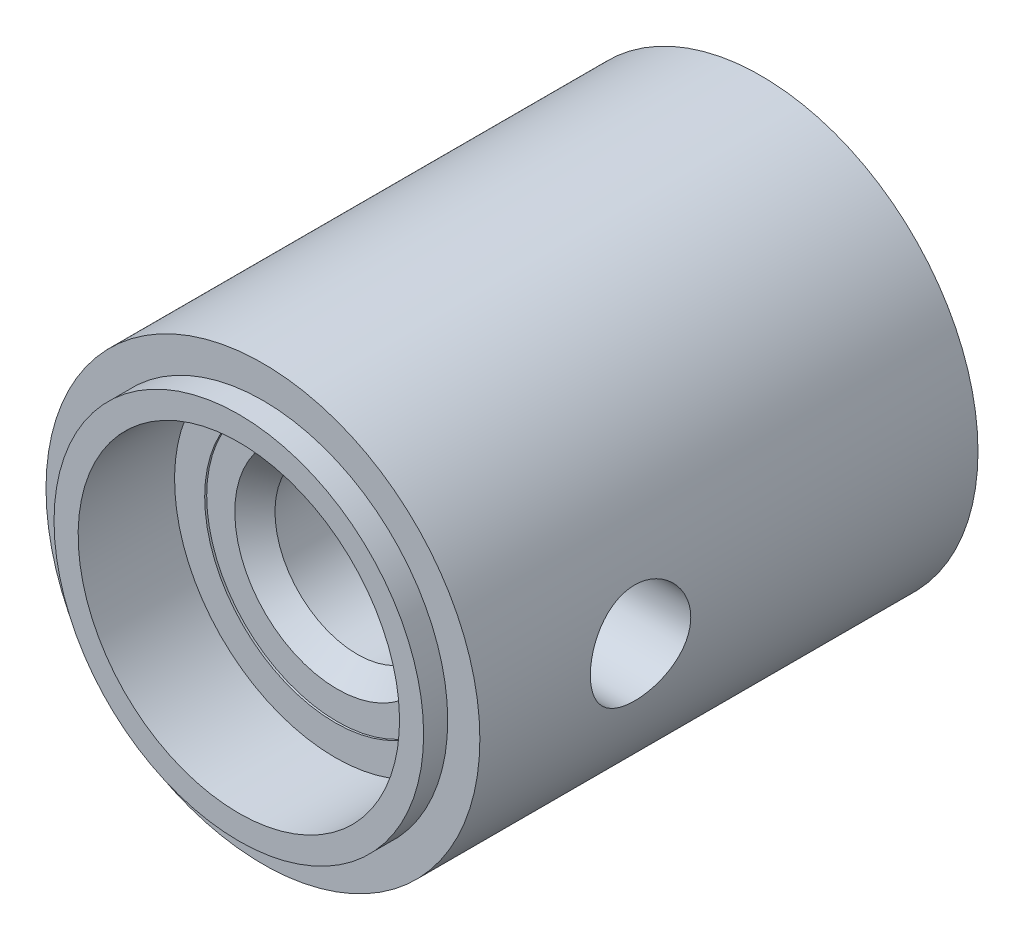
ISO-10303-21;
HEADER;
FILE_DESCRIPTION(('STEP AP214'),'2;1');
FILE_NAME('part.step','',(''),(''),'','','');
FILE_SCHEMA(('AUTOMOTIVE_DESIGN { 1 0 10303 214 1 1 1 1 }'));
ENDSEC;
DATA;
#1=APPLICATION_CONTEXT('core data for automotive mechanical design processes');
#2=APPLICATION_PROTOCOL_DEFINITION('international standard','automotive_design',2000,#1);
#3=PRODUCT_CONTEXT('',#1,'mechanical');
#4=PRODUCT('Part','Part','',(#3));
#5=PRODUCT_RELATED_PRODUCT_CATEGORY('part','',(#4));
#6=PRODUCT_DEFINITION_FORMATION('','',#4);
#7=PRODUCT_DEFINITION_CONTEXT('part definition',#1,'design');
#8=PRODUCT_DEFINITION('design','',#6,#7);
#9=PRODUCT_DEFINITION_SHAPE('','',#8);
#10=(LENGTH_UNIT() NAMED_UNIT(*) SI_UNIT(.MILLI.,.METRE.));
#11=(NAMED_UNIT(*) PLANE_ANGLE_UNIT() SI_UNIT($,.RADIAN.));
#12=(NAMED_UNIT(*) SI_UNIT($,.STERADIAN.) SOLID_ANGLE_UNIT());
#13=UNCERTAINTY_MEASURE_WITH_UNIT(LENGTH_MEASURE(1.E-05),#10,'distance_accuracy_value','');
#14=(GEOMETRIC_REPRESENTATION_CONTEXT(3) GLOBAL_UNCERTAINTY_ASSIGNED_CONTEXT((#13)) GLOBAL_UNIT_ASSIGNED_CONTEXT((#10,
#11,#12)) REPRESENTATION_CONTEXT('',''));
#15=CARTESIAN_POINT('',(0.,0.,0.));
#16=DIRECTION('',(0.,0.,1.));
#17=DIRECTION('',(1.,0.,0.));
#18=AXIS2_PLACEMENT_3D('',#15,#16,#17);
#19=CARTESIAN_POINT('',(0.,0.,124.));
#20=DIRECTION('',(0.,0.,-1.));
#21=DIRECTION('',(-1.,0.,0.));
#22=AXIS2_PLACEMENT_3D('',#19,#20,#21);
#23=CYLINDRICAL_SURFACE('',#22,54.);
#24=CARTESIAN_POINT('',(54.,2.22044604925031E-13,96.5));
#25=CARTESIAN_POINT('',(53.9999991283518,-0.346154811254162,96.4999983442547));
#26=CARTESIAN_POINT('',(53.9966631813621,-0.69234445027759,96.4856090232887));
#27=CARTESIAN_POINT('',(53.9834095670314,-1.38223725812821,96.4281644914496));
#28=CARTESIAN_POINT('',(53.9734910051967,-1.72594008261138,96.3851053847144));
#29=CARTESIAN_POINT('',(53.9473406441938,-2.40856064193267,96.2706425007982));
#30=CARTESIAN_POINT('',(53.9311051130138,-2.74747542514791,96.1992219674129));
#31=CARTESIAN_POINT('',(53.8927711589579,-3.41788796121193,96.0286193378688));
#32=CARTESIAN_POINT('',(53.8706729204595,-3.74938594695788,95.929438114757));
#33=CARTESIAN_POINT('',(53.8212482643726,-4.40230784196444,95.7042219597272));
#34=CARTESIAN_POINT('',(53.7939277090089,-4.72374258112491,95.5782171203545));
#35=CARTESIAN_POINT('',(53.7347847258636,-5.35474947369891,95.3002443205053));
#36=CARTESIAN_POINT('',(53.7029622674806,-5.6643215464583,95.148276183543));
#37=CARTESIAN_POINT('',(53.6356745163034,-6.26954008411762,94.8194944494338));
#38=CARTESIAN_POINT('',(53.6002093920336,-6.56518719232,94.642682001545));
#39=CARTESIAN_POINT('',(53.5265827388403,-7.14066585505397,94.265440636423));
#40=CARTESIAN_POINT('',(53.4884210995295,-7.42049676127224,94.0650107521375));
#41=CARTESIAN_POINT('',(53.4097951495491,-7.96688060824163,93.638507915042));
#42=CARTESIAN_POINT('',(53.3693037700556,-8.23314955810788,93.4120760638685));
#43=CARTESIAN_POINT('',(53.2877021597603,-8.74575164569198,92.9377717260088));
#44=CARTESIAN_POINT('',(53.2465919225227,-8.99208457591438,92.6898990162202));
#45=CARTESIAN_POINT('',(53.1648841798376,-9.46320609880626,92.174330764967));
#46=CARTESIAN_POINT('',(53.124286730884,-9.68799233533919,91.9066330612946));
#47=CARTESIAN_POINT('',(53.0447424166067,-10.1144633177635,91.3532080291935));
#48=CARTESIAN_POINT('',(53.0057955091764,-10.3161486531992,91.0674811611651));
#49=CARTESIAN_POINT('',(52.9301788734753,-10.6974026393397,90.4761771796908));
#50=CARTESIAN_POINT('',(52.8935439195541,-10.8766614460573,90.1703957088886));
#51=CARTESIAN_POINT('',(52.8241723423021,-11.2087289371851,89.5443612932754));
#52=CARTESIAN_POINT('',(52.791435760623,-11.3615373389966,89.2241081938942));
#53=CARTESIAN_POINT('',(52.7308468238226,-11.6395034671342,88.5714072002391));
#54=CARTESIAN_POINT('',(52.7029939555448,-11.7646640989111,88.2389605916431));
#55=CARTESIAN_POINT('',(52.6530205810564,-11.98634011075,87.5642310010921));
#56=CARTESIAN_POINT('',(52.6308999583988,-12.0828560727165,87.2219482191097));
#57=CARTESIAN_POINT('',(52.593406459515,-12.2450156136681,86.5360633360931));
#58=CARTESIAN_POINT('',(52.5779233094249,-12.3111651273173,86.1925868497247));
#59=CARTESIAN_POINT('',(52.5536279634346,-12.4144678669358,85.5010662246167));
#60=CARTESIAN_POINT('',(52.5448156977575,-12.4516213962007,85.1530221336927));
#61=CARTESIAN_POINT('',(52.534134006356,-12.4966115889184,84.4549800185812));
#62=CARTESIAN_POINT('',(52.5322637408562,-12.5044517984113,84.1049822358628));
#63=CARTESIAN_POINT('',(52.5355216779213,-12.4907570865095,83.4055968826546));
#64=CARTESIAN_POINT('',(52.5406497990204,-12.4692225070572,83.056209305109));
#65=CARTESIAN_POINT('',(52.5575693224059,-12.3977101268883,82.3678029453307));
#66=CARTESIAN_POINT('',(52.5692213997841,-12.3483269049185,82.0287187648615));
#67=CARTESIAN_POINT('',(52.5987427900533,-12.2219662998623,81.3560139805664));
#68=CARTESIAN_POINT('',(52.6166120048043,-12.1449893523528,81.0223932905842));
#69=CARTESIAN_POINT('',(52.6580491731704,-11.9640486595974,80.3629044380509));
#70=CARTESIAN_POINT('',(52.6816173695984,-11.8600837644793,80.0370366064707));
#71=CARTESIAN_POINT('',(52.7337774815675,-11.6259658900512,79.3952640742824));
#72=CARTESIAN_POINT('',(52.7623694656518,-11.4958125534296,79.0793595096797));
#73=CARTESIAN_POINT('',(52.8240431330697,-11.2090212041611,78.4568680796184));
#74=CARTESIAN_POINT('',(52.8571621015704,-11.052160266269,78.1503876361584));
#75=CARTESIAN_POINT('',(52.9267633238893,-10.7138940748925,77.5516906525274));
#76=CARTESIAN_POINT('',(52.9632455888741,-10.5324887399157,77.2594741597201));
#77=CARTESIAN_POINT('',(53.0385709544605,-10.1463625266328,76.6911447045009));
#78=CARTESIAN_POINT('',(53.0774143545079,-9.94163868811931,76.4150337933821));
#79=CARTESIAN_POINT('',(53.1564017717327,-9.51025868127216,75.8807091808685));
#80=CARTESIAN_POINT('',(53.1965458103184,-9.28360215180646,75.6224957742847));
#81=CARTESIAN_POINT('',(53.2780357860342,-8.80405958725021,75.1195622179907));
#82=CARTESIAN_POINT('',(53.3193871999183,-8.55066951251391,74.8753232852663));
#83=CARTESIAN_POINT('',(53.4011659668759,-8.02411651246397,74.4090023152823));
#84=CARTESIAN_POINT('',(53.4415933044523,-7.75095325586504,74.1869206494));
#85=CARTESIAN_POINT('',(53.5203973183108,-7.18666911594677,73.7664477662748));
#86=CARTESIAN_POINT('',(53.5587739322229,-6.89554768703433,73.5680572693391));
#87=CARTESIAN_POINT('',(53.6324032072448,-6.29731187622616,73.196395727014));
#88=CARTESIAN_POINT('',(53.6676558856672,-5.99019758297667,73.0231245424117));
#89=CARTESIAN_POINT('',(53.7341356663869,-5.36124162145522,72.702566740351));
#90=CARTESIAN_POINT('',(53.7653519239785,-5.0393633021194,72.5553497476753));
#91=CARTESIAN_POINT('',(53.8227622151943,-4.38388963816578,72.2886077574731));
#92=CARTESIAN_POINT('',(53.8489562258813,-4.05029424004299,72.1690828864191));
#93=CARTESIAN_POINT('',(53.8955672984906,-3.37383201241038,71.9587083889404));
#94=CARTESIAN_POINT('',(53.9159851285109,-3.03096642227039,71.8678549496949));
#95=CARTESIAN_POINT('',(53.9504571358018,-2.338450048876,71.7155652988398));
#96=CARTESIAN_POINT('',(53.9645114463164,-1.98879940785169,71.654128471283));
#97=CARTESIAN_POINT('',(53.9856113209214,-1.29312912151582,71.5622275957371));
#98=CARTESIAN_POINT('',(53.9928051533255,-0.947200447517947,71.5311079971349));
#99=CARTESIAN_POINT('',(54.000515951648,-0.253881031118812,71.497760605153));
#100=CARTESIAN_POINT('',(54.0010330159946,0.0935096896535838,71.4955323858596));
#101=CARTESIAN_POINT('',(53.9953760257445,0.787191219314259,71.5199851118093));
#102=CARTESIAN_POINT('',(53.9892024452853,1.13348210439915,71.5466640085284));
#103=CARTESIAN_POINT('',(53.9703379362719,1.8224679295123,71.628703881468));
#104=CARTESIAN_POINT('',(53.957647027737,2.16516288058288,71.6840647695861));
#105=CARTESIAN_POINT('',(53.9262993913182,2.84024646049301,71.8221422224451));
#106=CARTESIAN_POINT('',(53.9077190956459,3.17271033796417,71.9045087559264));
#107=CARTESIAN_POINT('',(53.8650511507829,3.82943172075758,72.0961161149275));
#108=CARTESIAN_POINT('',(53.8409635616657,4.15368931555102,72.205356647307));
#109=CARTESIAN_POINT('',(53.7879245432152,4.79183724144157,72.449889024993));
#110=CARTESIAN_POINT('',(53.7589727838715,5.1057268673922,72.5851826379655));
#111=CARTESIAN_POINT('',(53.6969754060504,5.72105467679928,72.8808252302677));
#112=CARTESIAN_POINT('',(53.6639297209581,6.02249265754044,73.0411746173074));
#113=CARTESIAN_POINT('',(53.5940716524558,6.61559118610248,73.3885016645606));
#114=CARTESIAN_POINT('',(53.5572083372605,6.90702434920809,73.5758573898678));
#115=CARTESIAN_POINT('',(53.4811531118696,7.47314179330541,73.9739391462593));
#116=CARTESIAN_POINT('',(53.4419611814102,7.74782592850305,74.1846653807302));
#117=CARTESIAN_POINT('',(53.3623003215942,8.27870597619139,74.6280921099851));
#118=CARTESIAN_POINT('',(53.3218312273121,8.53489948675223,74.8607954505614));
#119=CARTESIAN_POINT('',(53.240713938067,9.02710404041089,75.3466209227704));
#120=CARTESIAN_POINT('',(53.2000657414841,9.26311490055341,75.5997432394602));
#121=CARTESIAN_POINT('',(53.118856966559,9.71810469976796,76.1302428023199));
#122=CARTESIAN_POINT('',(53.0783158644566,9.93662624499617,76.4080155621387));
#123=CARTESIAN_POINT('',(52.99935856096,10.3495017368867,76.9812687982107));
#124=CARTESIAN_POINT('',(52.9609423926388,10.5438553074487,77.2767495499285));
#125=CARTESIAN_POINT('',(52.887352327669,10.9069839571498,77.8834103091074));
#126=CARTESIAN_POINT('',(52.8521783471664,11.075759697891,78.1945899102209));
#127=CARTESIAN_POINT('',(52.7861119851401,11.3864667204613,78.8305121708548));
#128=CARTESIAN_POINT('',(52.7552195502476,11.5283983369069,79.1552546612498));
#129=CARTESIAN_POINT('',(52.6988135249575,11.7835494282462,79.814070071756));
#130=CARTESIAN_POINT('',(52.673269296781,11.8969332453062,80.1480766958869));
#131=CARTESIAN_POINT('',(52.6281064050513,12.0951545193151,80.8248524566868));
#132=CARTESIAN_POINT('',(52.6084877313804,12.1799920250056,81.1676215783932));
#133=CARTESIAN_POINT('',(52.5757835707764,12.3203971684642,81.8593582756879));
#134=CARTESIAN_POINT('',(52.5626970836535,12.375969287337,82.208324893854));
#135=CARTESIAN_POINT('',(52.5434618506543,12.4573823608586,82.9098968500441));
#136=CARTESIAN_POINT('',(52.537312966193,12.4832239094028,83.2625021152409));
#137=CARTESIAN_POINT('',(52.5322088211595,12.5046850037835,83.9600128575298));
#138=CARTESIAN_POINT('',(52.5330807295311,12.5010306458017,84.3048949410186));
#139=CARTESIAN_POINT('',(52.5415820900508,12.4652512831434,84.9930906692949));
#140=CARTESIAN_POINT('',(52.5492114252959,12.4331267709985,85.3364043411125));
#141=CARTESIAN_POINT('',(52.570999228181,12.3406761701925,86.0189924805737));
#142=CARTESIAN_POINT('',(52.5851575575558,12.280350678746,86.358267033598));
#143=CARTESIAN_POINT('',(52.6195836271821,12.1319911232341,87.0303847220212));
#144=CARTESIAN_POINT('',(52.639851396669,12.0439569265735,87.3632278266353));
#145=CARTESIAN_POINT('',(52.6858019985167,11.8413259313471,88.0187275407687));
#146=CARTESIAN_POINT('',(52.7114606411166,11.7268475713262,88.3414224895167));
#147=CARTESIAN_POINT('',(52.7675137672462,11.4719876960415,88.975982848749));
#148=CARTESIAN_POINT('',(52.7979082241729,11.3316063262846,89.2878483200548));
#149=CARTESIAN_POINT('',(52.8625846438323,11.0259482557329,89.89873977075));
#150=CARTESIAN_POINT('',(52.8968669456865,10.8606693828131,90.1977646269617));
#151=CARTESIAN_POINT('',(52.9683745072335,10.5063765555461,90.7810391649284));
#152=CARTESIAN_POINT('',(53.0055998400893,10.317362011069,91.0652884790766));
#153=CARTESIAN_POINT('',(53.0828480832215,9.91234974349647,91.623442619069));
#154=CARTESIAN_POINT('',(53.1229151445021,9.69583974974958,91.8969697426979));
#155=CARTESIAN_POINT('',(53.2039567495494,9.24079968882185,92.4249078078079));
#156=CARTESIAN_POINT('',(53.2449313079634,9.00226926602428,92.6793184404489));
#157=CARTESIAN_POINT('',(53.3266665207499,8.50471608944755,93.167402932645));
#158=CARTESIAN_POINT('',(53.3674271240656,8.24568866209009,93.4010720369477));
#159=CARTESIAN_POINT('',(53.4476063086294,7.70889164492517,93.8460411810655));
#160=CARTESIAN_POINT('',(53.487024894671,7.43112212207282,94.0573413007856));
#161=CARTESIAN_POINT('',(53.5640125579013,6.85437396403341,94.4591064592991));
#162=CARTESIAN_POINT('',(53.6015451336883,6.55514015977679,94.6492124190875));
#163=CARTESIAN_POINT('',(53.6730528417528,5.94128449750717,95.0034865070261));
#164=CARTESIAN_POINT('',(53.7070279913817,5.62666271455964,95.1676547616889));
#165=CARTESIAN_POINT('',(53.7704318481082,4.9844459222645,95.4686959500955));
#166=CARTESIAN_POINT('',(53.7998636536349,4.65685994737794,95.6055875044509));
#167=CARTESIAN_POINT('',(53.8533607293085,3.99087270218004,95.8511113262724));
#168=CARTESIAN_POINT('',(53.8774268991715,3.6524732559812,95.9597483320046));
#169=CARTESIAN_POINT('',(53.914978426723,3.04101293399396,96.1276561331388));
#170=CARTESIAN_POINT('',(53.9296261903094,2.76954333941325,96.1925188041302));
#171=CARTESIAN_POINT('',(53.9549302082044,2.22269971359777,96.3039607246162));
#172=CARTESIAN_POINT('',(53.9655867529436,1.947325967972,96.3505413044631));
#173=CARTESIAN_POINT('',(53.9827159921762,1.39392147156101,96.4251739334183));
#174=CARTESIAN_POINT('',(53.9891882729649,1.11589046080479,96.4532241504065));
#175=CARTESIAN_POINT('',(53.9978301485338,0.558580329813716,96.4906357668074));
#176=CARTESIAN_POINT('',(54.0000007033057,0.279301501993409,96.5000013359692));
#177=CARTESIAN_POINT('',(54.,2.22044604925031E-13,96.5));
#178=B_SPLINE_CURVE_WITH_KNOTS('',3,(#24,#25,#26,#27,#28,#29,#30,#31,#32,#33,#34,#35,#36,#37,
#38,#39,#40,#41,#42,#43,#44,#45,#46,#47,#48,#49,#50,#51,#52,#53,#54,#55,#56,#57,#58,#59,#60,#61,
#62,#63,#64,#65,#66,#67,#68,#69,#70,#71,#72,#73,#74,#75,#76,#77,#78,#79,#80,#81,#82,#83,#84,#85,
#86,#87,#88,#89,#90,#91,#92,#93,#94,#95,#96,#97,#98,#99,#100,#101,#102,#103,#104,#105,#106,#107,
#108,#109,#110,#111,#112,#113,#114,#115,#116,#117,#118,#119,#120,#121,#122,#123,#124,#125,#126,
#127,#128,#129,#130,#131,#132,#133,#134,#135,#136,#137,#138,#139,#140,#141,#142,#143,#144,#145,
#146,#147,#148,#149,#150,#151,#152,#153,#154,#155,#156,#157,#158,#159,#160,#161,#162,#163,#164,
#165,#166,#167,#168,#169,#170,#171,#172,#173,#174,#175,#176,#177),.UNSPECIFIED.,.T.,.F.,(4,2,2,
2,2,2,2,2,2,2,2,2,2,2,2,2,2,2,2,2,2,2,2,2,2,2,2,2,2,2,2,2,2,2,2,2,2,2,2,2,2,2,2,2,2,2,2,2,2,2,2,
2,2,2,2,2,2,2,2,2,2,2,2,2,2,2,2,2,2,2,2,2,2,2,2,2,4),(0.,1.03821073803848,2.07656258461482,
3.11552881436343,4.15446237329076,5.19223647160824,6.23001762448907,7.26775078706402,
8.30552645598981,9.35990218149762,10.4142888796092,11.4687907439626,12.5232656910066,
13.5909942241192,14.6587341642449,15.7263618441996,16.793967834259,17.8430759822534,
18.892173156512,19.9411434170984,20.9901014670687,22.0174685064245,23.0448193291333,
24.0722139312405,25.0996225519356,26.1360697853827,27.1725204601297,28.2091028558278,
29.2457023222438,30.3075253128729,31.3693660976941,32.4312391585507,33.493106334218,
34.5577696502268,35.6224378285574,36.6869643641081,37.751468608817,38.7924074290718,
39.8333309038933,40.8741806177332,41.9150271344151,42.9428835267318,43.9707287077352,
44.9986436512217,46.0265753227815,47.0706229477971,48.1146796595625,49.1588717509772,
50.2030733069678,51.2690339935605,52.3350112664857,53.4009609618905,54.4668973691788,
55.5265494363535,56.5861996942111,57.6456876516207,58.7051544444225,59.7386215446634,
60.7720707663445,61.805498103573,62.8389303861616,63.8678209063025,64.8967056469561,
65.925680202318,66.9546803457058,68.0068796674381,69.0590959845324,70.1115529155308,
71.1640060868823,72.2322077124434,73.3004041276349,74.3678688145311,75.4351543728267,
76.2730193459108,77.1108233378796,77.9487101521838,78.7864099590096),.UNSPECIFIED.);
#179=CARTESIAN_POINT('',(54.,2.22044604925031E-13,96.5));
#180=VERTEX_POINT('',#179);
#181=EDGE_CURVE('E54',#180,#180,#178,.T.);
#182=ORIENTED_EDGE('',*,*,#181,.F.);
#183=EDGE_LOOP('',(#182));
#184=FACE_BOUND('',#183,.T.);
#185=CARTESIAN_POINT('',(0.,0.,0.));
#186=DIRECTION('',(0.,0.,1.));
#187=DIRECTION('',(1.,0.,0.));
#188=AXIS2_PLACEMENT_3D('',#185,#186,#187);
#189=CIRCLE('',#188,54.);
#190=CARTESIAN_POINT('',(54.,0.,0.));
#191=VERTEX_POINT('',#190);
#192=EDGE_CURVE('E125',#191,#191,#189,.T.);
#193=ORIENTED_EDGE('',*,*,#192,.T.);
#194=EDGE_LOOP('',(#193));
#195=FACE_BOUND('',#194,.T.);
#196=CARTESIAN_POINT('',(0.,0.,124.));
#197=DIRECTION('',(0.,0.,1.));
#198=DIRECTION('',(1.,0.,0.));
#199=AXIS2_PLACEMENT_3D('',#196,#197,#198);
#200=CIRCLE('',#199,54.);
#201=CARTESIAN_POINT('',(54.,0.,124.));
#202=VERTEX_POINT('',#201);
#203=EDGE_CURVE('E130',#202,#202,#200,.T.);
#204=ORIENTED_EDGE('',*,*,#203,.F.);
#205=EDGE_LOOP('',(#204));
#206=FACE_BOUND('',#205,.T.);
#207=CARTESIAN_POINT('',(-54.,2.22044604925031E-13,96.5000000000001));
#208=CARTESIAN_POINT('',(-53.9999991283518,0.346154811254598,96.4999983442548));
#209=CARTESIAN_POINT('',(-53.996663181362,0.692344450278017,96.4856090232887));
#210=CARTESIAN_POINT('',(-53.9834095670314,1.38223725812863,96.4281644914495));
#211=CARTESIAN_POINT('',(-53.9734910051967,1.7259400826118,96.3851053847144));
#212=CARTESIAN_POINT('',(-53.9473406441937,2.40856064193308,96.2706425007982));
#213=CARTESIAN_POINT('',(-53.9311051130138,2.74747542514832,96.1992219674129));
#214=CARTESIAN_POINT('',(-53.8927711589578,3.41788796121236,96.0286193378688));
#215=CARTESIAN_POINT('',(-53.8706729204594,3.74938594695833,95.9294381147571));
#216=CARTESIAN_POINT('',(-53.8212482643725,4.40230784196487,95.7042219597274));
#217=CARTESIAN_POINT('',(-53.7939277090088,4.7237425811253,95.5782171203545));
#218=CARTESIAN_POINT('',(-53.7347847258636,5.35474947369928,95.3002443205053));
#219=CARTESIAN_POINT('',(-53.7029622674806,5.66432154645868,95.148276183543));
#220=CARTESIAN_POINT('',(-53.6356745163034,6.26954008411798,94.8194944494338));
#221=CARTESIAN_POINT('',(-53.6002093920335,6.56518719232035,94.642682001545));
#222=CARTESIAN_POINT('',(-53.5265827388402,7.14066585505436,94.2654406364231));
#223=CARTESIAN_POINT('',(-53.4884210995295,7.4204967612727,94.0650107521377));
#224=CARTESIAN_POINT('',(-53.4097951495491,7.96688060824207,93.6385079150422));
#225=CARTESIAN_POINT('',(-53.3693037700555,8.23314955810824,93.4120760638686));
#226=CARTESIAN_POINT('',(-53.2877021597603,8.74575164569231,92.9377717260088));
#227=CARTESIAN_POINT('',(-53.2465919225227,8.99208457591475,92.6898990162203));
#228=CARTESIAN_POINT('',(-53.1648841798375,9.46320609880665,92.174330764967));
#229=CARTESIAN_POINT('',(-53.124286730884,9.68799233533955,91.9066330612946));
#230=CARTESIAN_POINT('',(-53.0447424166066,10.114463317764,91.3532080291936));
#231=CARTESIAN_POINT('',(-53.0057955091763,10.3161486531998,91.0674811611652));
#232=CARTESIAN_POINT('',(-52.9301788734752,10.6974026393403,90.4761771796909));
#233=CARTESIAN_POINT('',(-52.893543919554,10.8766614460577,90.1703957088887));
#234=CARTESIAN_POINT('',(-52.8241723423021,11.2087289371855,89.5443612932754));
#235=CARTESIAN_POINT('',(-52.791435760623,11.361537338997,89.2241081938943));
#236=CARTESIAN_POINT('',(-52.7308468238225,11.6395034671346,88.5714072002392));
#237=CARTESIAN_POINT('',(-52.7029939555446,11.7646640989115,88.2389605916431));
#238=CARTESIAN_POINT('',(-52.6530205810564,11.9863401107505,87.5642310010921));
#239=CARTESIAN_POINT('',(-52.6308999583989,12.082856072717,87.2219482191098));
#240=CARTESIAN_POINT('',(-52.5934064595151,12.2450156136686,86.5360633360932));
#241=CARTESIAN_POINT('',(-52.5779233094249,12.3111651273178,86.1925868497248));
#242=CARTESIAN_POINT('',(-52.5536279634344,12.4144678669362,85.5010662246168));
#243=CARTESIAN_POINT('',(-52.5448156977574,12.4516213962011,85.1530221336928));
#244=CARTESIAN_POINT('',(-52.5341340063559,12.4966115889189,84.4549800185813));
#245=CARTESIAN_POINT('',(-52.532263740856,12.5044517984118,84.1049822358629));
#246=CARTESIAN_POINT('',(-52.5355216779213,12.49075708651,83.4055968826547));
#247=CARTESIAN_POINT('',(-52.5406497990204,12.4692225070576,83.0562093051091));
#248=CARTESIAN_POINT('',(-52.557569322406,12.3977101268887,82.3678029453308));
#249=CARTESIAN_POINT('',(-52.5692213997841,12.348326904919,82.0287187648616));
#250=CARTESIAN_POINT('',(-52.5987427900531,12.2219662998628,81.3560139805665));
#251=CARTESIAN_POINT('',(-52.6166120048042,12.1449893523533,81.0223932905844));
#252=CARTESIAN_POINT('',(-52.6580491731703,11.9640486595979,80.362904438051));
#253=CARTESIAN_POINT('',(-52.6816173695983,11.8600837644798,80.0370366064708));
#254=CARTESIAN_POINT('',(-52.7337774815674,11.6259658900517,79.3952640742825));
#255=CARTESIAN_POINT('',(-52.7623694656517,11.4958125534301,79.0793595096798));
#256=CARTESIAN_POINT('',(-52.8240431330696,11.2090212041617,78.4568680796185));
#257=CARTESIAN_POINT('',(-52.8571621015703,11.0521602662695,78.1503876361585));
#258=CARTESIAN_POINT('',(-52.9267633238891,10.713894074893,77.5516906525275));
#259=CARTESIAN_POINT('',(-52.963245588874,10.5324887399162,77.2594741597202));
#260=CARTESIAN_POINT('',(-53.0385709544604,10.1463625266333,76.691144704501));
#261=CARTESIAN_POINT('',(-53.0774143545078,9.9416386881198,76.4150337933822));
#262=CARTESIAN_POINT('',(-53.1564017717326,9.51025868127267,75.8807091808686));
#263=CARTESIAN_POINT('',(-53.1965458103183,9.28360215180702,75.6224957742847));
#264=CARTESIAN_POINT('',(-53.2780357860342,8.80405958725077,75.1195622179907));
#265=CARTESIAN_POINT('',(-53.3193871999182,8.55066951251442,74.8753232852663));
#266=CARTESIAN_POINT('',(-53.4011659668758,8.02411651246446,74.4090023152824));
#267=CARTESIAN_POINT('',(-53.4415933044522,7.75095325586554,74.1869206494));
#268=CARTESIAN_POINT('',(-53.5203973183107,7.18666911594729,73.7664477662748));
#269=CARTESIAN_POINT('',(-53.5587739322229,6.89554768703486,73.5680572693392));
#270=CARTESIAN_POINT('',(-53.6324032072447,6.29731187622665,73.196395727014));
#271=CARTESIAN_POINT('',(-53.667655885667,5.99019758297712,73.0231245424118));
#272=CARTESIAN_POINT('',(-53.7341356663867,5.36124162145566,72.7025667403511));
#273=CARTESIAN_POINT('',(-53.7653519239784,5.03936330211986,72.5553497476753));
#274=CARTESIAN_POINT('',(-53.8227622151943,4.38388963816626,72.2886077574731));
#275=CARTESIAN_POINT('',(-53.8489562258813,4.05029424004346,72.1690828864191));
#276=CARTESIAN_POINT('',(-53.8955672984906,3.37383201241085,71.9587083889404));
#277=CARTESIAN_POINT('',(-53.9159851285108,3.03096642227086,71.8678549496949));
#278=CARTESIAN_POINT('',(-53.9504571358018,2.33845004887646,71.7155652988399));
#279=CARTESIAN_POINT('',(-53.9645114463164,1.98879940785214,71.6541284712831));
#280=CARTESIAN_POINT('',(-53.9856113209214,1.29312912151625,71.5622275957372));
#281=CARTESIAN_POINT('',(-53.9928051533255,0.947200447518386,71.5311079971349));
#282=CARTESIAN_POINT('',(-54.000515951648,0.253881031119254,71.497760605153));
#283=CARTESIAN_POINT('',(-54.0010330159946,-0.0935096896531413,71.4955323858596));
#284=CARTESIAN_POINT('',(-53.9953760257445,-0.787191219313816,71.5199851118093));
#285=CARTESIAN_POINT('',(-53.9892024452853,-1.13348210439871,71.5466640085284));
#286=CARTESIAN_POINT('',(-53.9703379362719,-1.82246792951185,71.628703881468));
#287=CARTESIAN_POINT('',(-53.9576470277371,-2.16516288058242,71.6840647695862));
#288=CARTESIAN_POINT('',(-53.9262993913183,-2.84024646049257,71.8221422224453));
#289=CARTESIAN_POINT('',(-53.9077190956459,-3.17271033796375,71.9045087559265));
#290=CARTESIAN_POINT('',(-53.8650511507829,-3.82943172075717,72.0961161149275));
#291=CARTESIAN_POINT('',(-53.8409635616658,-4.15368931555061,72.205356647307));
#292=CARTESIAN_POINT('',(-53.7879245432153,-4.79183724144116,72.449889024993));
#293=CARTESIAN_POINT('',(-53.7589727838715,-5.1057268673918,72.5851826379655));
#294=CARTESIAN_POINT('',(-53.6969754060504,-5.72105467679887,72.8808252302678));
#295=CARTESIAN_POINT('',(-53.6639297209581,-6.02249265753999,73.0411746173075));
#296=CARTESIAN_POINT('',(-53.5940716524559,-6.61559118610203,73.3885016645608));
#297=CARTESIAN_POINT('',(-53.5572083372605,-6.90702434920768,73.5758573898679));
#298=CARTESIAN_POINT('',(-53.4811531118697,-7.47314179330503,73.9739391462593));
#299=CARTESIAN_POINT('',(-53.4419611814103,-7.74782592850266,74.1846653807303));
#300=CARTESIAN_POINT('',(-53.3623003215943,-8.27870597619098,74.6280921099852));
#301=CARTESIAN_POINT('',(-53.3218312273121,-8.53489948675181,74.8607954505615));
#302=CARTESIAN_POINT('',(-53.2407139380671,-9.02710404041048,75.3466209227704));
#303=CARTESIAN_POINT('',(-53.2000657414843,-9.26311490055303,75.5997432394602));
#304=CARTESIAN_POINT('',(-53.1188569665591,-9.71810469976757,76.1302428023199));
#305=CARTESIAN_POINT('',(-53.0783158644567,-9.93662624499574,76.4080155621387));
#306=CARTESIAN_POINT('',(-52.99935856096,-10.3495017368863,76.9812687982107));
#307=CARTESIAN_POINT('',(-52.9609423926389,-10.5438553074482,77.2767495499285));
#308=CARTESIAN_POINT('',(-52.8873523276691,-10.9069839571494,77.8834103091074));
#309=CARTESIAN_POINT('',(-52.8521783471665,-11.0757596978906,78.194589910221));
#310=CARTESIAN_POINT('',(-52.7861119851402,-11.3864667204609,78.8305121708548));
#311=CARTESIAN_POINT('',(-52.7552195502476,-11.5283983369065,79.1552546612498));
#312=CARTESIAN_POINT('',(-52.6988135249575,-11.7835494282458,79.814070071756));
#313=CARTESIAN_POINT('',(-52.6732692967811,-11.8969332453058,80.1480766958869));
#314=CARTESIAN_POINT('',(-52.6281064050514,-12.0951545193147,80.8248524566869));
#315=CARTESIAN_POINT('',(-52.6084877313805,-12.1799920250052,81.1676215783933));
#316=CARTESIAN_POINT('',(-52.5757835707765,-12.3203971684637,81.8593582756879));
#317=CARTESIAN_POINT('',(-52.5626970836536,-12.3759692873365,82.2083248938541));
#318=CARTESIAN_POINT('',(-52.5434618506543,-12.4573823608582,82.9098968500442));
#319=CARTESIAN_POINT('',(-52.537312966193,-12.4832239094024,83.262502115241));
#320=CARTESIAN_POINT('',(-52.5322088211595,-12.5046850037831,83.9600128575299));
#321=CARTESIAN_POINT('',(-52.5330807295312,-12.5010306458013,84.3048949410187));
#322=CARTESIAN_POINT('',(-52.5415820900509,-12.4652512831429,84.9930906692949));
#323=CARTESIAN_POINT('',(-52.549211425296,-12.433126770998,85.3364043411125));
#324=CARTESIAN_POINT('',(-52.5709992281811,-12.3406761701921,86.0189924805737));
#325=CARTESIAN_POINT('',(-52.585157557556,-12.2803506787456,86.3582670335981));
#326=CARTESIAN_POINT('',(-52.6195836271821,-12.1319911232337,87.0303847220212));
#327=CARTESIAN_POINT('',(-52.639851396669,-12.0439569265732,87.3632278266353));
#328=CARTESIAN_POINT('',(-52.6858019985167,-11.8413259313468,88.0187275407687));
#329=CARTESIAN_POINT('',(-52.7114606411166,-11.7268475713258,88.3414224895167));
#330=CARTESIAN_POINT('',(-52.7675137672463,-11.471987696041,88.975982848749));
#331=CARTESIAN_POINT('',(-52.797908224173,-11.3316063262842,89.2878483200548));
#332=CARTESIAN_POINT('',(-52.8625846438324,-11.0259482557325,89.89873977075));
#333=CARTESIAN_POINT('',(-52.8968669456865,-10.8606693828126,90.1977646269618));
#334=CARTESIAN_POINT('',(-52.9683745072336,-10.5063765555456,90.7810391649284));
#335=CARTESIAN_POINT('',(-53.0055998400894,-10.3173620110685,91.0652884790767));
#336=CARTESIAN_POINT('',(-53.0828480832217,-9.91234974349603,91.6234426190691));
#337=CARTESIAN_POINT('',(-53.1229151445022,-9.69583974974912,91.8969697426979));
#338=CARTESIAN_POINT('',(-53.2039567495494,-9.24079968882137,92.424907807808));
#339=CARTESIAN_POINT('',(-53.2449313079635,-9.00226926602382,92.6793184404489));
#340=CARTESIAN_POINT('',(-53.32666652075,-8.50471608944711,93.167402932645));
#341=CARTESIAN_POINT('',(-53.3674271240656,-8.24568866208966,93.4010720369477));
#342=CARTESIAN_POINT('',(-53.4476063086294,-7.70889164492478,93.8460411810655));
#343=CARTESIAN_POINT('',(-53.487024894671,-7.43112212207247,94.0573413007856));
#344=CARTESIAN_POINT('',(-53.5640125579013,-6.85437396403308,94.4591064592991));
#345=CARTESIAN_POINT('',(-53.6015451336883,-6.55514015977643,94.6492124190874));
#346=CARTESIAN_POINT('',(-53.6730528417529,-5.94128449750679,95.0034865070261));
#347=CARTESIAN_POINT('',(-53.7070279913817,-5.62666271455925,95.1676547616889));
#348=CARTESIAN_POINT('',(-53.7704318481082,-4.9844459222641,95.4686959500955));
#349=CARTESIAN_POINT('',(-53.799863653635,-4.65685994737753,95.6055875044508));
#350=CARTESIAN_POINT('',(-53.8533607293085,-3.99087270217961,95.8511113262724));
#351=CARTESIAN_POINT('',(-53.8774268991715,-3.65247325598077,95.9597483320046));
#352=CARTESIAN_POINT('',(-53.914978426723,-3.04101293399352,96.1276561331388));
#353=CARTESIAN_POINT('',(-53.9296261903094,-2.7695433394128,96.1925188041302));
#354=CARTESIAN_POINT('',(-53.9549302082045,-2.22269971359732,96.3039607246162));
#355=CARTESIAN_POINT('',(-53.9655867529436,-1.94732596797154,96.3505413044631));
#356=CARTESIAN_POINT('',(-53.9827159921762,-1.39392147156055,96.4251739334183));
#357=CARTESIAN_POINT('',(-53.9891882729649,-1.11589046080433,96.4532241504065));
#358=CARTESIAN_POINT('',(-53.9978301485338,-0.558580329813265,96.4906357668074));
#359=CARTESIAN_POINT('',(-54.0000007033057,-0.279301501992962,96.5000013359693));
#360=CARTESIAN_POINT('',(-54.,2.22044604925031E-13,96.5000000000001));
#361=B_SPLINE_CURVE_WITH_KNOTS('',3,(#207,#208,#209,#210,#211,#212,#213,#214,#215,#216,#217,
#218,#219,#220,#221,#222,#223,#224,#225,#226,#227,#228,#229,#230,#231,#232,#233,#234,#235,#236,
#237,#238,#239,#240,#241,#242,#243,#244,#245,#246,#247,#248,#249,#250,#251,#252,#253,#254,#255,
#256,#257,#258,#259,#260,#261,#262,#263,#264,#265,#266,#267,#268,#269,#270,#271,#272,#273,#274,
#275,#276,#277,#278,#279,#280,#281,#282,#283,#284,#285,#286,#287,#288,#289,#290,#291,#292,#293,
#294,#295,#296,#297,#298,#299,#300,#301,#302,#303,#304,#305,#306,#307,#308,#309,#310,#311,#312,
#313,#314,#315,#316,#317,#318,#319,#320,#321,#322,#323,#324,#325,#326,#327,#328,#329,#330,#331,
#332,#333,#334,#335,#336,#337,#338,#339,#340,#341,#342,#343,#344,#345,#346,#347,#348,#349,#350,
#351,#352,#353,#354,#355,#356,#357,#358,#359,#360),.UNSPECIFIED.,.T.,.F.,(4,2,2,2,2,2,2,2,2,2,2,
2,2,2,2,2,2,2,2,2,2,2,2,2,2,2,2,2,2,2,2,2,2,2,2,2,2,2,2,2,2,2,2,2,2,2,2,2,2,2,2,2,2,2,2,2,2,2,2,
2,2,2,2,2,2,2,2,2,2,2,2,2,2,2,2,2,4),(0.,1.03821073803846,2.0765625846148,3.11552881436342,
4.15446237329074,5.19223647160818,6.23001762448901,7.26775078706394,8.30552645598969,
9.35990218149751,10.4142888796091,11.4687907439626,12.5232656910066,13.5909942241192,
14.6587341642449,15.7263618441996,16.7939678342589,17.8430759822533,18.8921731565119,
19.9411434170984,20.9901014670686,22.0174685064245,23.0448193291333,24.0722139312404,
25.0996225519355,26.1360697853826,27.1725204601296,28.2091028558277,29.2457023222438,
30.3075253128728,31.3693660976941,32.4312391585507,33.493106334218,34.5577696502268,
35.6224378285575,36.6869643641081,37.751468608817,38.7924074290718,39.8333309038933,
40.8741806177332,41.9150271344151,42.9428835267319,43.9707287077353,44.9986436512218,
46.0265753227816,47.0706229477972,48.1146796595626,49.1588717509773,50.2030733069678,
51.2690339935605,52.3350112664857,53.4009609618906,54.4668973691788,55.5265494363536,
56.5861996942112,57.6456876516208,58.7051544444226,59.7386215446636,60.7720707663446,
61.805498103573,62.8389303861616,63.8678209063025,64.8967056469562,65.9256802023181,
66.9546803457059,68.0068796674382,69.0590959845324,70.1115529155308,71.1640060868823,
72.2322077124433,73.3004041276349,74.3678688145311,75.4351543728268,76.2730193459108,
77.1108233378796,77.9487101521839,78.7864099590096),.UNSPECIFIED.);
#362=CARTESIAN_POINT('',(-54.,2.22044604925031E-13,96.5000000000001));
#363=VERTEX_POINT('',#362);
#364=EDGE_CURVE('E11',#363,#363,#361,.T.);
#365=ORIENTED_EDGE('',*,*,#364,.F.);
#366=EDGE_LOOP('',(#365));
#367=FACE_BOUND('',#366,.T.);
#368=ADVANCED_FACE('F40',(#184,#195,#206,#367),#23,.T.);
#369=CARTESIAN_POINT('',(0.,0.,124.));
#370=DIRECTION('',(0.,0.,1.));
#371=DIRECTION('',(1.,0.,0.));
#372=AXIS2_PLACEMENT_3D('',#369,#370,#371);
#373=PLANE('',#372);
#374=CARTESIAN_POINT('',(0.,0.,124.));
#375=DIRECTION('',(0.,0.,1.));
#376=DIRECTION('',(1.,0.,0.));
#377=AXIS2_PLACEMENT_3D('',#374,#375,#376);
#378=CIRCLE('',#377,45.9999999999999);
#379=CARTESIAN_POINT('',(45.9999999999999,0.,124.));
#380=VERTEX_POINT('',#379);
#381=EDGE_CURVE('E126',#380,#380,#378,.T.);
#382=ORIENTED_EDGE('',*,*,#381,.F.);
#383=EDGE_LOOP('',(#382));
#384=FACE_BOUND('',#383,.T.);
#385=ORIENTED_EDGE('',*,*,#203,.T.);
#386=EDGE_LOOP('',(#385));
#387=FACE_BOUND('',#386,.T.);
#388=ADVANCED_FACE('F194',(#384,#387),#373,.T.);
#389=CARTESIAN_POINT('',(0.,0.,0.));
#390=DIRECTION('',(0.,0.,1.));
#391=DIRECTION('',(1.,0.,0.));
#392=AXIS2_PLACEMENT_3D('',#389,#390,#391);
#393=PLANE('',#392);
#394=CARTESIAN_POINT('',(2.22044604925031E-13,0.,0.));
#395=DIRECTION('',(0.,0.,1.));
#396=DIRECTION('',(0.,-1.,0.));
#397=AXIS2_PLACEMENT_3D('',#394,#395,#396);
#398=CIRCLE('',#397,40.0000000000008);
#399=CARTESIAN_POINT('',(2.22044604925031E-13,-40.0000000000008,0.));
#400=VERTEX_POINT('',#399);
#401=EDGE_CURVE('E113',#400,#400,#398,.T.);
#402=ORIENTED_EDGE('',*,*,#401,.T.);
#403=EDGE_LOOP('',(#402));
#404=FACE_BOUND('',#403,.T.);
#405=ORIENTED_EDGE('',*,*,#192,.F.);
#406=EDGE_LOOP('',(#405));
#407=FACE_BOUND('',#406,.T.);
#408=ADVANCED_FACE('F192',(#404,#407),#393,.F.);
#409=CARTESIAN_POINT('',(0.,0.,130.));
#410=DIRECTION('',(0.,0.,-1.));
#411=DIRECTION('',(-1.,0.,0.));
#412=AXIS2_PLACEMENT_3D('',#409,#410,#411);
#413=CYLINDRICAL_SURFACE('',#412,45.9999999999999);
#414=CARTESIAN_POINT('',(0.,0.,130.));
#415=DIRECTION('',(0.,0.,1.));
#416=DIRECTION('',(1.,0.,0.));
#417=AXIS2_PLACEMENT_3D('',#414,#415,#416);
#418=CIRCLE('',#417,45.9999999999999);
#419=CARTESIAN_POINT('',(45.9999999999999,0.,130.));
#420=VERTEX_POINT('',#419);
#421=EDGE_CURVE('E121',#420,#420,#418,.T.);
#422=ORIENTED_EDGE('',*,*,#421,.F.);
#423=EDGE_LOOP('',(#422));
#424=FACE_BOUND('',#423,.T.);
#425=ORIENTED_EDGE('',*,*,#381,.T.);
#426=EDGE_LOOP('',(#425));
#427=FACE_BOUND('',#426,.T.);
#428=ADVANCED_FACE('F188',(#424,#427),#413,.T.);
#429=CARTESIAN_POINT('',(0.,0.,130.));
#430=DIRECTION('',(0.,0.,1.));
#431=DIRECTION('',(1.,0.,0.));
#432=AXIS2_PLACEMENT_3D('',#429,#430,#431);
#433=PLANE('',#432);
#434=CARTESIAN_POINT('',(1.66533453693773E-13,0.,130.));
#435=DIRECTION('',(0.,0.,1.));
#436=DIRECTION('',(0.,-1.,0.));
#437=AXIS2_PLACEMENT_3D('',#434,#435,#436);
#438=CIRCLE('',#437,40.0000000000008);
#439=CARTESIAN_POINT('',(1.66533453693773E-13,-40.0000000000008,130.));
#440=VERTEX_POINT('',#439);
#441=EDGE_CURVE('E117',#440,#440,#438,.T.);
#442=ORIENTED_EDGE('',*,*,#441,.F.);
#443=EDGE_LOOP('',(#442));
#444=FACE_BOUND('',#443,.T.);
#445=ORIENTED_EDGE('',*,*,#421,.T.);
#446=EDGE_LOOP('',(#445));
#447=FACE_BOUND('',#446,.T.);
#448=ADVANCED_FACE('F184',(#444,#447),#433,.T.);
#449=CARTESIAN_POINT('',(1.66533453693773E-13,0.,130.));
#450=DIRECTION('',(0.,0.,1.));
#451=DIRECTION('',(0.,-1.,0.));
#452=AXIS2_PLACEMENT_3D('',#449,#450,#451);
#453=CYLINDRICAL_SURFACE('',#452,40.0000000000008);
#454=ORIENTED_EDGE('',*,*,#441,.T.);
#455=EDGE_LOOP('',(#454));
#456=FACE_BOUND('',#455,.T.);
#457=CARTESIAN_POINT('',(1.66533453693773E-13,0.,106.000000000001));
#458=DIRECTION('',(0.,0.,1.));
#459=DIRECTION('',(0.,-1.,0.));
#460=AXIS2_PLACEMENT_3D('',#457,#458,#459);
#461=CIRCLE('',#460,40.0000000000008);
#462=CARTESIAN_POINT('',(1.66533453693773E-13,-40.0000000000008,106.000000000001));
#463=VERTEX_POINT('',#462);
#464=EDGE_CURVE('E75',#463,#463,#461,.T.);
#465=ORIENTED_EDGE('',*,*,#464,.F.);
#466=EDGE_LOOP('',(#465));
#467=FACE_BOUND('',#466,.T.);
#468=ADVANCED_FACE('F180',(#456,#467),#453,.F.);
#469=CARTESIAN_POINT('',(1.66533453693773E-13,0.,130.));
#470=DIRECTION('',(0.,0.,1.));
#471=DIRECTION('',(0.,-1.,0.));
#472=AXIS2_PLACEMENT_3D('',#469,#470,#471);
#473=CYLINDRICAL_SURFACE('',#472,40.0000000000008);
#474=CARTESIAN_POINT('',(1.66533453693773E-13,0.,45.0000000000012));
#475=DIRECTION('',(0.,0.,1.));
#476=DIRECTION('',(0.,-1.,0.));
#477=AXIS2_PLACEMENT_3D('',#474,#475,#476);
#478=CIRCLE('',#477,40.0000000000008);
#479=CARTESIAN_POINT('',(1.66533453693773E-13,-40.0000000000008,45.0000000000012));
#480=VERTEX_POINT('',#479);
#481=EDGE_CURVE('E109',#480,#480,#478,.T.);
#482=ORIENTED_EDGE('',*,*,#481,.T.);
#483=EDGE_LOOP('',(#482));
#484=FACE_BOUND('',#483,.T.);
#485=ORIENTED_EDGE('',*,*,#401,.F.);
#486=EDGE_LOOP('',(#485));
#487=FACE_BOUND('',#486,.T.);
#488=ADVANCED_FACE('F176',(#484,#487),#473,.F.);
#489=CARTESIAN_POINT('',(40.0000000000011,2.22044604925031E-13,45.0000000000012));
#490=DIRECTION('',(0.,0.,-1.));
#491=DIRECTION('',(0.,1.,0.));
#492=AXIS2_PLACEMENT_3D('',#489,#490,#491);
#493=PLANE('',#492);
#494=CARTESIAN_POINT('',(1.66533453693773E-13,0.,45.0000000000012));
#495=DIRECTION('',(0.,0.,1.));
#496=DIRECTION('',(0.,-1.,0.));
#497=AXIS2_PLACEMENT_3D('',#494,#495,#496);
#498=CIRCLE('',#497,34.0500000000013);
#499=CARTESIAN_POINT('',(1.66533453693773E-13,-34.0500000000013,45.0000000000012));
#500=VERTEX_POINT('',#499);
#501=EDGE_CURVE('E105',#500,#500,#498,.T.);
#502=ORIENTED_EDGE('',*,*,#501,.T.);
#503=EDGE_LOOP('',(#502));
#504=FACE_BOUND('',#503,.T.);
#505=ORIENTED_EDGE('',*,*,#481,.F.);
#506=EDGE_LOOP('',(#505));
#507=FACE_BOUND('',#506,.T.);
#508=ADVANCED_FACE('F172',(#504,#507),#493,.T.);
#509=CARTESIAN_POINT('',(1.66533453693773E-13,0.,130.));
#510=DIRECTION('',(0.,0.,1.));
#511=DIRECTION('',(0.,-1.,0.));
#512=AXIS2_PLACEMENT_3D('',#509,#510,#511);
#513=CYLINDRICAL_SURFACE('',#512,34.0500000000013);
#514=CARTESIAN_POINT('',(2.22044604925031E-13,0.,63.0000000000009));
#515=DIRECTION('',(0.,0.,1.));
#516=DIRECTION('',(0.,-1.,0.));
#517=AXIS2_PLACEMENT_3D('',#514,#515,#516);
#518=CIRCLE('',#517,34.0500000000013);
#519=CARTESIAN_POINT('',(2.22044604925031E-13,-34.0500000000013,63.000000000001));
#520=VERTEX_POINT('',#519);
#521=EDGE_CURVE('E101',#520,#520,#518,.T.);
#522=ORIENTED_EDGE('',*,*,#521,.T.);
#523=EDGE_LOOP('',(#522));
#524=FACE_BOUND('',#523,.T.);
#525=ORIENTED_EDGE('',*,*,#501,.F.);
#526=EDGE_LOOP('',(#525));
#527=FACE_BOUND('',#526,.T.);
#528=ADVANCED_FACE('F168',(#524,#527),#513,.F.);
#529=CARTESIAN_POINT('',(34.0500000000014,2.22044604925031E-13,63.0000000000007));
#530=DIRECTION('',(0.,0.,-1.));
#531=DIRECTION('',(0.,1.,0.));
#532=AXIS2_PLACEMENT_3D('',#529,#530,#531);
#533=PLANE('',#532);
#534=CARTESIAN_POINT('',(2.22044604925031E-13,0.,63.0000000000009));
#535=DIRECTION('',(0.,0.,1.));
#536=DIRECTION('',(0.,-1.,0.));
#537=AXIS2_PLACEMENT_3D('',#534,#535,#536);
#538=CIRCLE('',#537,20.5000000000014);
#539=CARTESIAN_POINT('',(2.22044604925031E-13,-20.5000000000015,63.0000000000009));
#540=VERTEX_POINT('',#539);
#541=EDGE_CURVE('E97',#540,#540,#538,.T.);
#542=ORIENTED_EDGE('',*,*,#541,.T.);
#543=EDGE_LOOP('',(#542));
#544=FACE_BOUND('',#543,.T.);
#545=ORIENTED_EDGE('',*,*,#521,.F.);
#546=EDGE_LOOP('',(#545));
#547=FACE_BOUND('',#546,.T.);
#548=ADVANCED_FACE('F164',(#544,#547),#533,.T.);
#549=CARTESIAN_POINT('',(1.66533453693773E-13,0.,130.));
#550=DIRECTION('',(0.,0.,1.));
#551=DIRECTION('',(0.,-1.,0.));
#552=AXIS2_PLACEMENT_3D('',#549,#550,#551);
#553=CYLINDRICAL_SURFACE('',#552,20.5000000000014);
#554=CARTESIAN_POINT('',(2.22044604925031E-13,0.,100.500000000002));
#555=DIRECTION('',(0.,0.,1.));
#556=DIRECTION('',(0.,-1.,0.));
#557=AXIS2_PLACEMENT_3D('',#554,#555,#556);
#558=CIRCLE('',#557,20.5000000000015);
#559=CARTESIAN_POINT('',(2.22044604925031E-13,-20.5000000000015,100.500000000002));
#560=VERTEX_POINT('',#559);
#561=EDGE_CURVE('E93',#560,#560,#558,.T.);
#562=ORIENTED_EDGE('',*,*,#561,.T.);
#563=EDGE_LOOP('',(#562));
#564=FACE_BOUND('',#563,.T.);
#565=ORIENTED_EDGE('',*,*,#541,.F.);
#566=EDGE_LOOP('',(#565));
#567=FACE_BOUND('',#566,.T.);
#568=ADVANCED_FACE('F160',(#564,#567),#553,.F.);
#569=CARTESIAN_POINT('',(2.22044604925031E-13,0.,100.500000000002));
#570=DIRECTION('',(0.,0.,1.));
#571=DIRECTION('',(0.,-1.,0.));
#572=AXIS2_PLACEMENT_3D('',#569,#570,#571);
#573=CONICAL_SURFACE('',#572,20.5000000000015,0.785398163397448);
#574=CARTESIAN_POINT('',(1.66533453693773E-13,0.,105.500000000001));
#575=DIRECTION('',(0.,0.,1.));
#576=DIRECTION('',(0.,-1.,0.));
#577=AXIS2_PLACEMENT_3D('',#574,#575,#576);
#578=CIRCLE('',#577,25.5000000000005);
#579=CARTESIAN_POINT('',(1.66533453693773E-13,-25.5000000000005,105.500000000001));
#580=VERTEX_POINT('',#579);
#581=EDGE_CURVE('E89',#580,#580,#578,.T.);
#582=ORIENTED_EDGE('',*,*,#581,.T.);
#583=EDGE_LOOP('',(#582));
#584=FACE_BOUND('',#583,.T.);
#585=ORIENTED_EDGE('',*,*,#561,.F.);
#586=EDGE_LOOP('',(#585));
#587=FACE_BOUND('',#586,.T.);
#588=ADVANCED_FACE('F156',(#584,#587),#573,.F.);
#589=CARTESIAN_POINT('',(25.5000000000007,2.22044604925031E-13,105.500000000001));
#590=DIRECTION('',(0.,0.,1.));
#591=DIRECTION('',(0.,-1.,0.));
#592=AXIS2_PLACEMENT_3D('',#589,#590,#591);
#593=PLANE('',#592);
#594=CARTESIAN_POINT('',(1.66533453693773E-13,0.,105.500000000001));
#595=DIRECTION('',(0.,0.,1.));
#596=DIRECTION('',(0.,-1.,0.));
#597=AXIS2_PLACEMENT_3D('',#594,#595,#596);
#598=CIRCLE('',#597,32.500000000001);
#599=CARTESIAN_POINT('',(1.66533453693773E-13,-32.5000000000011,105.500000000001));
#600=VERTEX_POINT('',#599);
#601=EDGE_CURVE('E85',#600,#600,#598,.T.);
#602=ORIENTED_EDGE('',*,*,#601,.T.);
#603=EDGE_LOOP('',(#602));
#604=FACE_BOUND('',#603,.T.);
#605=ORIENTED_EDGE('',*,*,#581,.F.);
#606=EDGE_LOOP('',(#605));
#607=FACE_BOUND('',#606,.T.);
#608=ADVANCED_FACE('F152',(#604,#607),#593,.T.);
#609=CARTESIAN_POINT('',(1.66533453693773E-13,0.,130.));
#610=DIRECTION('',(0.,0.,1.));
#611=DIRECTION('',(0.,-1.,0.));
#612=AXIS2_PLACEMENT_3D('',#609,#610,#611);
#613=CYLINDRICAL_SURFACE('',#612,32.500000000001);
#614=CARTESIAN_POINT('',(1.66533453693773E-13,0.,106.000000000001));
#615=DIRECTION('',(0.,0.,1.));
#616=DIRECTION('',(0.,-1.,0.));
#617=AXIS2_PLACEMENT_3D('',#614,#615,#616);
#618=CIRCLE('',#617,32.500000000001);
#619=CARTESIAN_POINT('',(1.66533453693773E-13,-32.5000000000011,106.000000000001));
#620=VERTEX_POINT('',#619);
#621=EDGE_CURVE('E81',#620,#620,#618,.T.);
#622=ORIENTED_EDGE('',*,*,#621,.T.);
#623=EDGE_LOOP('',(#622));
#624=FACE_BOUND('',#623,.T.);
#625=ORIENTED_EDGE('',*,*,#601,.F.);
#626=EDGE_LOOP('',(#625));
#627=FACE_BOUND('',#626,.T.);
#628=ADVANCED_FACE('F148',(#624,#627),#613,.F.);
#629=CARTESIAN_POINT('',(32.5000000000013,2.22044604925031E-13,106.000000000001));
#630=DIRECTION('',(0.,0.,1.));
#631=DIRECTION('',(0.,-1.,0.));
#632=AXIS2_PLACEMENT_3D('',#629,#630,#631);
#633=PLANE('',#632);
#634=ORIENTED_EDGE('',*,*,#464,.T.);
#635=EDGE_LOOP('',(#634));
#636=FACE_BOUND('',#635,.T.);
#637=ORIENTED_EDGE('',*,*,#621,.F.);
#638=EDGE_LOOP('',(#637));
#639=FACE_BOUND('',#638,.T.);
#640=ADVANCED_FACE('F145',(#636,#639),#633,.T.);
#641=CARTESIAN_POINT('',(-70.3946683328127,2.22044604925031E-13,84.0000000000001));
#642=DIRECTION('',(-1.,0.,0.));
#643=DIRECTION('',(0.,0.,1.));
#644=AXIS2_PLACEMENT_3D('',#641,#642,#643);
#645=CYLINDRICAL_SURFACE('',#644,12.5);
#646=CARTESIAN_POINT('',(34.,2.22044604925031E-13,83.9999999999997));
#647=DIRECTION('',(-1.,0.,0.));
#648=DIRECTION('',(0.,0.,1.));
#649=AXIS2_PLACEMENT_3D('',#646,#647,#648);
#650=CIRCLE('',#649,12.5);
#651=CARTESIAN_POINT('',(34.,2.22044604925032E-13,96.4999999999998));
#652=VERTEX_POINT('',#651);
#653=EDGE_CURVE('E67',#652,#652,#650,.T.);
#654=ORIENTED_EDGE('',*,*,#653,.T.);
#655=EDGE_LOOP('',(#654));
#656=FACE_BOUND('',#655,.T.);
#657=ORIENTED_EDGE('',*,*,#181,.T.);
#658=EDGE_LOOP('',(#657));
#659=FACE_BOUND('',#658,.T.);
#660=ADVANCED_FACE('F63',(#656,#659),#645,.F.);
#661=CARTESIAN_POINT('',(34.,2.22044604925031E-13,83.9999999999997));
#662=DIRECTION('',(1.,0.,0.));
#663=DIRECTION('',(0.,0.,-1.));
#664=AXIS2_PLACEMENT_3D('',#661,#662,#663);
#665=CONICAL_SURFACE('',#664,12.5,1.08210413623649);
#666=CARTESIAN_POINT('',(27.3536321042315,2.22044604925031E-13,84.));
#667=VERTEX_POINT('',#666);
#668=VERTEX_LOOP('',#667);
#669=FACE_BOUND('',#668,.T.);
#670=ORIENTED_EDGE('',*,*,#653,.F.);
#671=EDGE_LOOP('',(#670));
#672=FACE_BOUND('',#671,.T.);
#673=ADVANCED_FACE('F59',(#669,#672),#665,.F.);
#674=CARTESIAN_POINT('',(-70.3946683328127,2.22044604925031E-13,84.0000000000001));
#675=DIRECTION('',(-1.,0.,0.));
#676=DIRECTION('',(0.,0.,1.));
#677=AXIS2_PLACEMENT_3D('',#674,#675,#676);
#678=CYLINDRICAL_SURFACE('',#677,12.5);
#679=CARTESIAN_POINT('',(-34.,2.22044604925031E-13,84.));
#680=DIRECTION('',(-1.,0.,0.));
#681=DIRECTION('',(0.,0.,1.));
#682=AXIS2_PLACEMENT_3D('',#679,#680,#681);
#683=CIRCLE('',#682,12.5);
#684=CARTESIAN_POINT('',(-34.,2.22044604925032E-13,96.5));
#685=VERTEX_POINT('',#684);
#686=EDGE_CURVE('E70',#685,#685,#683,.T.);
#687=ORIENTED_EDGE('',*,*,#686,.F.);
#688=EDGE_LOOP('',(#687));
#689=FACE_BOUND('',#688,.T.);
#690=ORIENTED_EDGE('',*,*,#364,.T.);
#691=EDGE_LOOP('',(#690));
#692=FACE_BOUND('',#691,.T.);
#693=ADVANCED_FACE('F62',(#689,#692),#678,.F.);
#694=CARTESIAN_POINT('',(-27.3536321042315,2.22044604925031E-13,84.0000000000001));
#695=DIRECTION('',(-1.,0.,0.));
#696=DIRECTION('',(0.,0.,1.));
#697=AXIS2_PLACEMENT_3D('',#694,#695,#696);
#698=CONICAL_SURFACE('',#697,0.,1.08210413623649);
#699=ORIENTED_EDGE('',*,*,#686,.T.);
#700=EDGE_LOOP('',(#699));
#701=FACE_BOUND('',#700,.T.);
#702=CARTESIAN_POINT('',(-27.3536321042315,2.22044604925031E-13,84.0000000000001));
#703=VERTEX_POINT('',#702);
#704=VERTEX_LOOP('',#703);
#705=FACE_BOUND('',#704,.T.);
#706=ADVANCED_FACE('F215',(#701,#705),#698,.F.);
#707=CLOSED_SHELL('',(#368,#388,#408,#428,#448,#468,#488,#508,#528,#548,#568,#588,#608,#628,
#640,#660,#673,#693,#706));
#708=MANIFOLD_SOLID_BREP('B2',#707);
#709=ADVANCED_BREP_SHAPE_REPRESENTATION('',(#18,#708),#14);
#710=SHAPE_DEFINITION_REPRESENTATION(#9,#709);
ENDSEC;
END-ISO-10303-21;
